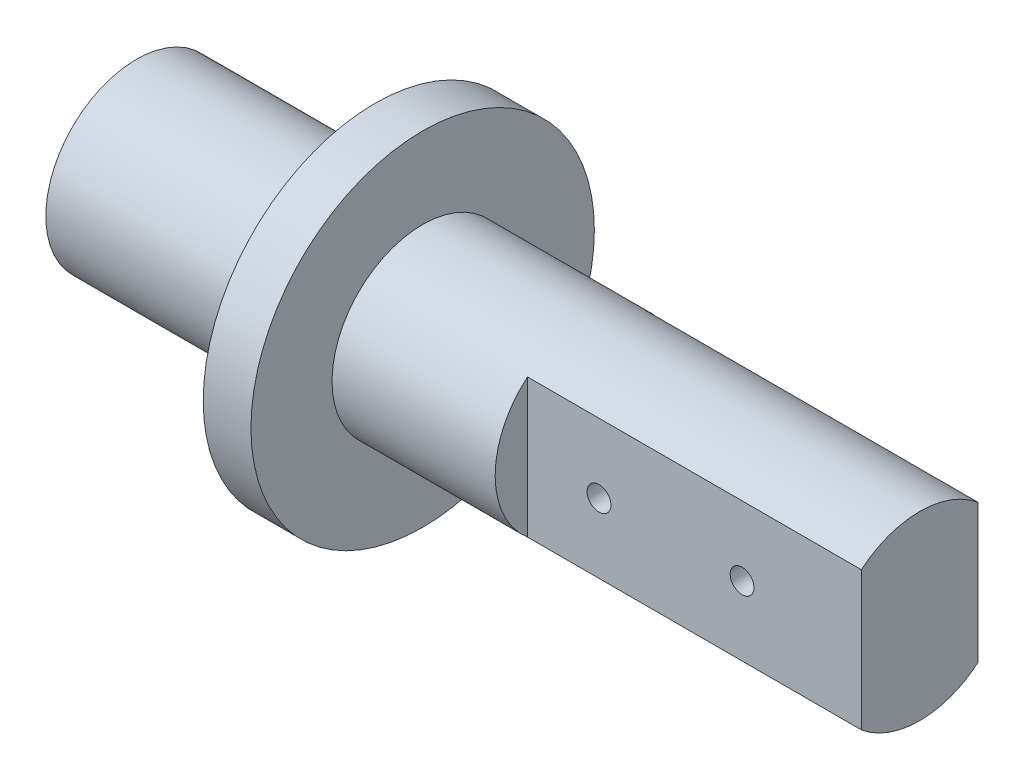
ISO-10303-21;
HEADER;
FILE_DESCRIPTION(('STEP AP214'),'2;1');
FILE_NAME('part.step','',(''),(''),'','','');
FILE_SCHEMA(('AUTOMOTIVE_DESIGN { 1 0 10303 214 1 1 1 1 }'));
ENDSEC;
DATA;
#1=APPLICATION_CONTEXT('core data for automotive mechanical design processes');
#2=APPLICATION_PROTOCOL_DEFINITION('international standard','automotive_design',2000,#1);
#3=PRODUCT_CONTEXT('',#1,'mechanical');
#4=PRODUCT('Part','Part','',(#3));
#5=PRODUCT_RELATED_PRODUCT_CATEGORY('part','',(#4));
#6=PRODUCT_DEFINITION_FORMATION('','',#4);
#7=PRODUCT_DEFINITION_CONTEXT('part definition',#1,'design');
#8=PRODUCT_DEFINITION('design','',#6,#7);
#9=PRODUCT_DEFINITION_SHAPE('','',#8);
#10=(LENGTH_UNIT() NAMED_UNIT(*) SI_UNIT(.MILLI.,.METRE.));
#11=(NAMED_UNIT(*) PLANE_ANGLE_UNIT() SI_UNIT($,.RADIAN.));
#12=(NAMED_UNIT(*) SI_UNIT($,.STERADIAN.) SOLID_ANGLE_UNIT());
#13=UNCERTAINTY_MEASURE_WITH_UNIT(LENGTH_MEASURE(1.E-05),#10,'distance_accuracy_value','');
#14=(GEOMETRIC_REPRESENTATION_CONTEXT(3) GLOBAL_UNCERTAINTY_ASSIGNED_CONTEXT((#13)) GLOBAL_UNIT_ASSIGNED_CONTEXT((#10,
#11,#12)) REPRESENTATION_CONTEXT('',''));
#15=CARTESIAN_POINT('',(0.,0.,0.));
#16=DIRECTION('',(0.,0.,1.));
#17=DIRECTION('',(1.,0.,0.));
#18=AXIS2_PLACEMENT_3D('',#15,#16,#17);
#19=CARTESIAN_POINT('',(0.,0.,0.));
#20=DIRECTION('',(-1.,0.,0.));
#21=DIRECTION('',(0.,0.,1.));
#22=AXIS2_PLACEMENT_3D('',#19,#20,#21);
#23=CYLINDRICAL_SURFACE('',#22,9.5);
#24=CARTESIAN_POINT('',(18.7571862711397,-0.133843323913922,9.49905710924214));
#25=CARTESIAN_POINT('',(18.7497191225898,-0.0644792715354372,9.50003343309708));
#26=CARTESIAN_POINT('',(18.7480669160832,0.00556405323647919,9.50025344602568));
#27=CARTESIAN_POINT('',(18.7564698736311,0.144979561522329,9.4991501404317));
#28=CARTESIAN_POINT('',(18.766536582819,0.214351015191011,9.49782529996253));
#29=CARTESIAN_POINT('',(18.7980796029942,0.350366331225342,9.49378059106666));
#30=CARTESIAN_POINT('',(18.8195490331772,0.417011812445685,9.49106156397555));
#31=CARTESIAN_POINT('',(18.8732622691699,0.545734422655254,9.48453117210074));
#32=CARTESIAN_POINT('',(18.9055043688729,0.607812273138289,9.48071998030071));
#33=CARTESIAN_POINT('',(18.980012367083,0.725964552348348,9.47240745265404));
#34=CARTESIAN_POINT('',(19.0223221240447,0.782011109915849,9.46790312848224));
#35=CARTESIAN_POINT('',(19.1157064001351,0.886240137139336,9.45871669072787));
#36=CARTESIAN_POINT('',(19.1667815153281,0.934422071547889,9.45403456507126));
#37=CARTESIAN_POINT('',(19.276627488953,1.02185619495898,9.44498592507392));
#38=CARTESIAN_POINT('',(19.3354441844691,1.06105105031087,9.44062155209812));
#39=CARTESIAN_POINT('',(19.4588782560648,1.12900411397511,9.43273687670716));
#40=CARTESIAN_POINT('',(19.5234955036514,1.15776255340239,9.42921655560101));
#41=CARTESIAN_POINT('',(19.6564987756165,1.20392977740594,9.42343337261771));
#42=CARTESIAN_POINT('',(19.7248727157887,1.22137287959152,9.4211667117012));
#43=CARTESIAN_POINT('',(19.8636103529643,1.24452529660299,9.41813651838227));
#44=CARTESIAN_POINT('',(19.9339739399041,1.25023525920218,9.41737290299852));
#45=CARTESIAN_POINT('',(20.0741180473625,1.2497517017472,9.41743702976489));
#46=CARTESIAN_POINT('',(20.1438989048636,1.24364904358161,9.41825262474987));
#47=CARTESIAN_POINT('',(20.2814336529233,1.21990371925658,9.42135745067241));
#48=CARTESIAN_POINT('',(20.3491875416964,1.20226104293217,9.42364668290801));
#49=CARTESIAN_POINT('',(20.480743116948,1.15596182651778,9.42943754488172));
#50=CARTESIAN_POINT('',(20.5445458358198,1.12730817768202,9.43293885632892));
#51=CARTESIAN_POINT('',(20.6664552359945,1.05980782384128,9.44076039951871));
#52=CARTESIAN_POINT('',(20.7245616357526,1.02096061536062,9.4450806717081));
#53=CARTESIAN_POINT('',(20.8338984806609,0.933828974038488,9.45409385220929));
#54=CARTESIAN_POINT('',(20.885073778255,0.885475593717308,9.45878932455992));
#55=CARTESIAN_POINT('',(20.9786065215152,0.780866430075416,9.4679986824394));
#56=CARTESIAN_POINT('',(21.0209637465793,0.724610449113877,9.47251256342309));
#57=CARTESIAN_POINT('',(21.0958030235709,0.605539355360445,9.48086976017443));
#58=CARTESIAN_POINT('',(21.1282487731954,0.542701236249752,9.48471058940574));
#59=CARTESIAN_POINT('',(21.1821115457805,0.412408807957424,9.49126803634612));
#60=CARTESIAN_POINT('',(21.203529026196,0.344954690379857,9.49398470068487));
#61=CARTESIAN_POINT('',(21.2346061809182,0.207763032854201,9.49797421108078));
#62=CARTESIAN_POINT('',(21.2443337745644,0.138041124441231,9.4992553944454));
#63=CARTESIAN_POINT('',(21.2519651241998,-0.00205653685352284,9.50025797279816));
#64=CARTESIAN_POINT('',(21.249869366228,-0.0724322627391881,9.49997943190406));
#65=CARTESIAN_POINT('',(21.2339681065827,-0.211383856020531,9.49790067530691));
#66=CARTESIAN_POINT('',(21.2202346292857,-0.279968125199801,9.49610981936629));
#67=CARTESIAN_POINT('',(21.1815597652179,-0.413850068958151,9.49121796297753));
#68=CARTESIAN_POINT('',(21.1566181539444,-0.479147677675186,9.48811693628631));
#69=CARTESIAN_POINT('',(21.096156312494,-0.604829835387539,9.48093661981255));
#70=CARTESIAN_POINT('',(21.0606043437987,-0.665198941952211,9.47685440224967));
#71=CARTESIAN_POINT('',(20.9799543620407,-0.779141796266092,9.46816815868444));
#72=CARTESIAN_POINT('',(20.9348558578671,-0.832715194190853,9.46356410584252));
#73=CARTESIAN_POINT('',(20.8359870238673,-0.931970546159648,9.45430798542196));
#74=CARTESIAN_POINT('',(20.7821536989094,-0.9775897640859,9.44965581802707));
#75=CARTESIAN_POINT('',(20.6675606826757,-1.05915474905901,9.44086222125012));
#76=CARTESIAN_POINT('',(20.6068009758146,-1.09510049433848,9.43672079301734));
#77=CARTESIAN_POINT('',(20.4800260933277,-1.15630060773529,9.42941800330284));
#78=CARTESIAN_POINT('',(20.4140086301521,-1.18155029167616,9.42625707137639));
#79=CARTESIAN_POINT('',(20.2786196091799,-1.22058753162685,9.42128212839032));
#80=CARTESIAN_POINT('',(20.2092482258022,-1.23437568301045,9.41946804736853));
#81=CARTESIAN_POINT('',(20.0696770146042,-1.25001578901799,9.41740533972257));
#82=CARTESIAN_POINT('',(19.9994872830052,-1.25195636866387,9.41714509008395));
#83=CARTESIAN_POINT('',(19.8597839001592,-1.24407956860155,9.4181888493365));
#84=CARTESIAN_POINT('',(19.7902702339264,-1.23426245012179,9.41949282347429));
#85=CARTESIAN_POINT('',(19.6541538459982,-1.20322302888803,9.42350758955671));
#86=CARTESIAN_POINT('',(19.587541324056,-1.1820429706235,9.42621316941837));
#87=CARTESIAN_POINT('',(19.4588147107473,-1.12892288538793,9.43272202907677));
#88=CARTESIAN_POINT('',(19.3967006531188,-1.09698277772767,9.43652531710514));
#89=CARTESIAN_POINT('',(19.2783359388641,-1.02303423463727,9.4448286559659));
#90=CARTESIAN_POINT('',(19.2221213242369,-0.980968558751438,9.4493326146031));
#91=CARTESIAN_POINT('',(19.1175063990004,-0.888032217775664,9.45851856141931));
#92=CARTESIAN_POINT('',(19.0691080485902,-0.837159350584597,9.46320059389391));
#93=CARTESIAN_POINT('',(18.9811880300445,-0.72765848566234,9.47225147965771));
#94=CARTESIAN_POINT('',(18.9417281493417,-0.668980707507695,9.47661801890231));
#95=CARTESIAN_POINT('',(18.8732619564631,-0.545816303637497,9.48450716558606));
#96=CARTESIAN_POINT('',(18.8442446968534,-0.481335850307806,9.48803065552202));
#97=CARTESIAN_POINT('',(18.804886095254,-0.369491516358376,9.49292106017614));
#98=CARTESIAN_POINT('',(18.7915404773749,-0.323175076086507,9.49461755714822));
#99=CARTESIAN_POINT('',(18.7702681725671,-0.229294778749665,9.49734856170854));
#100=CARTESIAN_POINT('',(18.762341446779,-0.181730930632482,9.49838307404391));
#101=CARTESIAN_POINT('',(18.7571862711397,-0.133843323913922,9.49905710924214));
#102=B_SPLINE_CURVE_WITH_KNOTS('',3,(#24,#25,#26,#27,#28,#29,#30,#31,#32,#33,#34,#35,#36,#37,
#38,#39,#40,#41,#42,#43,#44,#45,#46,#47,#48,#49,#50,#51,#52,#53,#54,#55,#56,#57,#58,#59,#60,#61,
#62,#63,#64,#65,#66,#67,#68,#69,#70,#71,#72,#73,#74,#75,#76,#77,#78,#79,#80,#81,#82,#83,#84,#85,
#86,#87,#88,#89,#90,#91,#92,#93,#94,#95,#96,#97,#98,#99,#100,#101),.UNSPECIFIED.,.T.,.F.,(4,2,2,
2,2,2,2,2,2,2,2,2,2,2,2,2,2,2,2,2,2,2,2,2,2,2,2,2,2,2,2,2,2,2,2,2,2,2,4),(0.,0.209139655009107,
0.418485522785862,0.627705207165943,0.836891772359222,1.04700687661839,1.25713627485178,
1.4685710582632,1.68000115915521,1.8907869907077,2.10156118470126,2.31072055855557,
2.51988011664733,2.72898479124065,2.93809979578234,3.14879151172392,3.35948849791804,
3.57094818879147,3.78239910756716,3.9926154431566,4.20282313715398,4.41173930435003,
4.62065965639331,4.83021131987617,5.03977376613028,5.25092086306614,5.46206843512397,
5.67330838067465,5.88453735259802,6.09418428390281,6.30382655743177,6.51269478176198,
6.721564572422,6.93164405516653,7.14177614108067,7.35331922359407,7.56463988619237,
7.70902691413943,7.85341290666598),.UNSPECIFIED.);
#103=CARTESIAN_POINT('',(18.7571862711397,-0.133843323913922,9.49905710924214));
#104=VERTEX_POINT('',#103);
#105=EDGE_CURVE('E12',#104,#104,#102,.T.);
#106=ORIENTED_EDGE('',*,*,#105,.T.);
#107=EDGE_LOOP('',(#106));
#108=FACE_BOUND('',#107,.T.);
#109=CARTESIAN_POINT('',(0.,0.,0.));
#110=DIRECTION('',(1.,0.,0.));
#111=DIRECTION('',(0.,0.,-1.));
#112=AXIS2_PLACEMENT_3D('',#109,#110,#111);
#113=CIRCLE('',#112,9.5);
#114=CARTESIAN_POINT('',(0.,0.,-9.5));
#115=VERTEX_POINT('',#114);
#116=EDGE_CURVE('E173',#115,#115,#113,.F.);
#117=ORIENTED_EDGE('',*,*,#116,.F.);
#118=EDGE_LOOP('',(#117));
#119=FACE_BOUND('',#118,.T.);
#120=CARTESIAN_POINT('',(25.,0.,0.));
#121=DIRECTION('',(1.,0.,0.));
#122=DIRECTION('',(0.,0.,-1.));
#123=AXIS2_PLACEMENT_3D('',#120,#121,#122);
#124=CIRCLE('',#123,9.5);
#125=CARTESIAN_POINT('',(25.,0.,-9.5));
#126=VERTEX_POINT('',#125);
#127=EDGE_CURVE('E50',#126,#126,#124,.T.);
#128=ORIENTED_EDGE('',*,*,#127,.F.);
#129=EDGE_LOOP('',(#128));
#130=FACE_BOUND('',#129,.T.);
#131=ADVANCED_FACE('F46',(#108,#119,#130),#23,.T.);
#132=CARTESIAN_POINT('',(0.,0.,0.));
#133=DIRECTION('',(1.,0.,0.));
#134=DIRECTION('',(0.,0.,-1.));
#135=AXIS2_PLACEMENT_3D('',#132,#133,#134);
#136=PLANE('',#135);
#137=ORIENTED_EDGE('',*,*,#116,.T.);
#138=EDGE_LOOP('',(#137));
#139=FACE_BOUND('',#138,.T.);
#140=ADVANCED_FACE('F209',(#139),#136,.F.);
#141=CARTESIAN_POINT('',(25.,0.,0.));
#142=DIRECTION('',(1.,0.,0.));
#143=DIRECTION('',(0.,0.,-1.));
#144=AXIS2_PLACEMENT_3D('',#141,#142,#143);
#145=CYLINDRICAL_SURFACE('',#144,18.);
#146=CARTESIAN_POINT('',(25.,0.,0.));
#147=DIRECTION('',(1.,0.,0.));
#148=DIRECTION('',(0.,0.,-1.));
#149=AXIS2_PLACEMENT_3D('',#146,#147,#148);
#150=CIRCLE('',#149,18.);
#151=CARTESIAN_POINT('',(25.,0.,-18.));
#152=VERTEX_POINT('',#151);
#153=EDGE_CURVE('E137',#152,#152,#150,.T.);
#154=ORIENTED_EDGE('',*,*,#153,.T.);
#155=EDGE_LOOP('',(#154));
#156=FACE_BOUND('',#155,.T.);
#157=CARTESIAN_POINT('',(30.,0.,0.));
#158=DIRECTION('',(1.,0.,0.));
#159=DIRECTION('',(0.,0.,-1.));
#160=AXIS2_PLACEMENT_3D('',#157,#158,#159);
#161=CIRCLE('',#160,18.);
#162=CARTESIAN_POINT('',(30.,0.,-18.));
#163=VERTEX_POINT('',#162);
#164=EDGE_CURVE('E136',#163,#163,#161,.T.);
#165=ORIENTED_EDGE('',*,*,#164,.F.);
#166=EDGE_LOOP('',(#165));
#167=FACE_BOUND('',#166,.T.);
#168=ADVANCED_FACE('F201',(#156,#167),#145,.T.);
#169=CARTESIAN_POINT('',(25.,0.,0.));
#170=DIRECTION('',(1.,0.,0.));
#171=DIRECTION('',(0.,0.,-1.));
#172=AXIS2_PLACEMENT_3D('',#169,#170,#171);
#173=PLANE('',#172);
#174=ORIENTED_EDGE('',*,*,#127,.T.);
#175=EDGE_LOOP('',(#174));
#176=FACE_BOUND('',#175,.T.);
#177=ORIENTED_EDGE('',*,*,#153,.F.);
#178=EDGE_LOOP('',(#177));
#179=FACE_BOUND('',#178,.T.);
#180=ADVANCED_FACE('F197',(#176,#179),#173,.F.);
#181=CARTESIAN_POINT('',(30.,0.,0.));
#182=DIRECTION('',(1.,0.,0.));
#183=DIRECTION('',(0.,0.,-1.));
#184=AXIS2_PLACEMENT_3D('',#181,#182,#183);
#185=PLANE('',#184);
#186=CARTESIAN_POINT('',(30.,0.,0.));
#187=DIRECTION('',(1.,0.,0.));
#188=DIRECTION('',(0.,0.,-1.));
#189=AXIS2_PLACEMENT_3D('',#186,#187,#188);
#190=CIRCLE('',#189,9.5);
#191=CARTESIAN_POINT('',(30.,0.,-9.5));
#192=VERTEX_POINT('',#191);
#193=EDGE_CURVE('E140',#192,#192,#190,.T.);
#194=ORIENTED_EDGE('',*,*,#193,.F.);
#195=EDGE_LOOP('',(#194));
#196=FACE_BOUND('',#195,.T.);
#197=ORIENTED_EDGE('',*,*,#164,.T.);
#198=EDGE_LOOP('',(#197));
#199=FACE_BOUND('',#198,.T.);
#200=ADVANCED_FACE('F200',(#196,#199),#185,.T.);
#201=CARTESIAN_POINT('',(47.1,10.,0.));
#202=DIRECTION('',(-1.,0.,0.));
#203=DIRECTION('',(0.,0.,1.));
#204=AXIS2_PLACEMENT_3D('',#201,#202,#203);
#205=PLANE('',#204);
#206=DIRECTION('',(0.,1.,0.));
#207=VECTOR('',#206,1.);
#208=CARTESIAN_POINT('',(47.1,10.,-6.11437827766147));
#209=LINE('',#208,#207);
#210=CARTESIAN_POINT('',(47.1,-7.27078938476845,-6.11437827766147));
#211=VERTEX_POINT('',#210);
#212=CARTESIAN_POINT('',(47.1,7.27078938476845,-6.11437827766147));
#213=VERTEX_POINT('',#212);
#214=EDGE_CURVE('E158',#211,#213,#209,.T.);
#215=ORIENTED_EDGE('',*,*,#214,.F.);
#216=CARTESIAN_POINT('',(47.1,0.,0.));
#217=DIRECTION('',(-1.,0.,0.));
#218=DIRECTION('',(0.,0.,1.));
#219=AXIS2_PLACEMENT_3D('',#216,#217,#218);
#220=CIRCLE('',#219,9.5);
#221=EDGE_CURVE('E87',#213,#211,#220,.T.);
#222=ORIENTED_EDGE('',*,*,#221,.F.);
#223=EDGE_LOOP('',(#215,#222));
#224=FACE_BOUND('',#223,.T.);
#225=ADVANCED_FACE('F205',(#224),#205,.F.);
#226=CARTESIAN_POINT('',(77.1,-7.5,-6.11437827766147));
#227=DIRECTION('',(0.,0.,1.));
#228=DIRECTION('',(1.,0.,0.));
#229=AXIS2_PLACEMENT_3D('',#226,#227,#228);
#230=PLANE('',#229);
#231=CARTESIAN_POINT('',(69.6,0.,-6.11437827766147));
#232=DIRECTION('',(0.,0.,1.));
#233=DIRECTION('',(1.,0.,0.));
#234=AXIS2_PLACEMENT_3D('',#231,#232,#233);
#235=CIRCLE('',#234,1.24999999999999);
#236=CARTESIAN_POINT('',(70.85,0.,-6.11437827766147));
#237=VERTEX_POINT('',#236);
#238=EDGE_CURVE('E125',#237,#237,#235,.F.);
#239=ORIENTED_EDGE('',*,*,#238,.F.);
#240=EDGE_LOOP('',(#239));
#241=FACE_BOUND('',#240,.T.);
#242=CARTESIAN_POINT('',(54.6,0.,-6.11437827766147));
#243=DIRECTION('',(0.,0.,1.));
#244=DIRECTION('',(1.,0.,0.));
#245=AXIS2_PLACEMENT_3D('',#242,#243,#244);
#246=CIRCLE('',#245,1.24999999999999);
#247=CARTESIAN_POINT('',(55.85,0.,-6.11437827766147));
#248=VERTEX_POINT('',#247);
#249=EDGE_CURVE('E129',#248,#248,#246,.F.);
#250=ORIENTED_EDGE('',*,*,#249,.F.);
#251=EDGE_LOOP('',(#250));
#252=FACE_BOUND('',#251,.T.);
#253=ORIENTED_EDGE('',*,*,#214,.T.);
#254=DIRECTION('',(-1.,0.,0.));
#255=VECTOR('',#254,1.);
#256=CARTESIAN_POINT('',(82.1,7.27078938476845,-6.11437827766147));
#257=LINE('',#256,#255);
#258=CARTESIAN_POINT('',(82.1,7.27078938476845,-6.11437827766147));
#259=VERTEX_POINT('',#258);
#260=EDGE_CURVE('E146',#259,#213,#257,.T.);
#261=ORIENTED_EDGE('',*,*,#260,.F.);
#262=DIRECTION('',(0.,1.,0.));
#263=VECTOR('',#262,1.);
#264=CARTESIAN_POINT('',(82.1,-7.5,-6.11437827766147));
#265=LINE('',#264,#263);
#266=CARTESIAN_POINT('',(82.1,-7.27078938476845,-6.11437827766147));
#267=VERTEX_POINT('',#266);
#268=EDGE_CURVE('E164',#267,#259,#265,.T.);
#269=ORIENTED_EDGE('',*,*,#268,.F.);
#270=DIRECTION('',(-1.,0.,0.));
#271=VECTOR('',#270,1.);
#272=CARTESIAN_POINT('',(82.1,-7.27078938476845,-6.11437827766147));
#273=LINE('',#272,#271);
#274=EDGE_CURVE('E150',#267,#211,#273,.T.);
#275=ORIENTED_EDGE('',*,*,#274,.T.);
#276=EDGE_LOOP('',(#253,#261,#269,#275));
#277=FACE_BOUND('',#276,.T.);
#278=ADVANCED_FACE('F246',(#241,#252,#277),#230,.F.);
#279=CARTESIAN_POINT('',(77.1,-7.5,6.11437827766147));
#280=DIRECTION('',(0.,0.,-1.));
#281=DIRECTION('',(-1.,0.,0.));
#282=AXIS2_PLACEMENT_3D('',#279,#280,#281);
#283=PLANE('',#282);
#284=CARTESIAN_POINT('',(54.6,0.,6.11437827766147));
#285=DIRECTION('',(0.,0.,-1.));
#286=DIRECTION('',(-1.,0.,0.));
#287=AXIS2_PLACEMENT_3D('',#284,#285,#286);
#288=CIRCLE('',#287,1.24999999999999);
#289=CARTESIAN_POINT('',(53.35,0.,6.11437827766147));
#290=VERTEX_POINT('',#289);
#291=EDGE_CURVE('E114',#290,#290,#288,.F.);
#292=ORIENTED_EDGE('',*,*,#291,.F.);
#293=EDGE_LOOP('',(#292));
#294=FACE_BOUND('',#293,.T.);
#295=CARTESIAN_POINT('',(69.6,0.,6.11437827766147));
#296=DIRECTION('',(0.,0.,-1.));
#297=DIRECTION('',(-1.,0.,0.));
#298=AXIS2_PLACEMENT_3D('',#295,#296,#297);
#299=CIRCLE('',#298,1.24999999999999);
#300=CARTESIAN_POINT('',(68.35,0.,6.11437827766147));
#301=VERTEX_POINT('',#300);
#302=EDGE_CURVE('E113',#301,#301,#299,.F.);
#303=ORIENTED_EDGE('',*,*,#302,.F.);
#304=EDGE_LOOP('',(#303));
#305=FACE_BOUND('',#304,.T.);
#306=DIRECTION('',(0.,-1.,0.));
#307=VECTOR('',#306,1.);
#308=CARTESIAN_POINT('',(47.1,10.,6.11437827766147));
#309=LINE('',#308,#307);
#310=CARTESIAN_POINT('',(47.1,7.27078938476845,6.11437827766147));
#311=VERTEX_POINT('',#310);
#312=CARTESIAN_POINT('',(47.1,-7.27078938476845,6.11437827766147));
#313=VERTEX_POINT('',#312);
#314=EDGE_CURVE('E155',#311,#313,#309,.T.);
#315=ORIENTED_EDGE('',*,*,#314,.T.);
#316=DIRECTION('',(-1.,0.,0.));
#317=VECTOR('',#316,1.);
#318=CARTESIAN_POINT('',(82.1,-7.27078938476845,6.11437827766147));
#319=LINE('',#318,#317);
#320=CARTESIAN_POINT('',(82.1,-7.27078938476845,6.11437827766147));
#321=VERTEX_POINT('',#320);
#322=EDGE_CURVE('E147',#321,#313,#319,.T.);
#323=ORIENTED_EDGE('',*,*,#322,.F.);
#324=DIRECTION('',(0.,-1.,0.));
#325=VECTOR('',#324,1.);
#326=CARTESIAN_POINT('',(82.1,-7.5,6.11437827766147));
#327=LINE('',#326,#325);
#328=CARTESIAN_POINT('',(82.1,7.27078938476845,6.11437827766147));
#329=VERTEX_POINT('',#328);
#330=EDGE_CURVE('E120',#329,#321,#327,.T.);
#331=ORIENTED_EDGE('',*,*,#330,.F.);
#332=DIRECTION('',(-1.,0.,0.));
#333=VECTOR('',#332,1.);
#334=CARTESIAN_POINT('',(82.1,7.27078938476845,6.11437827766147));
#335=LINE('',#334,#333);
#336=EDGE_CURVE('E143',#329,#311,#335,.T.);
#337=ORIENTED_EDGE('',*,*,#336,.T.);
#338=EDGE_LOOP('',(#315,#323,#331,#337));
#339=FACE_BOUND('',#338,.T.);
#340=ADVANCED_FACE('F48',(#294,#305,#339),#283,.F.);
#341=ORIENTED_EDGE('',*,*,#314,.F.);
#342=CARTESIAN_POINT('',(47.1,0.,0.));
#343=DIRECTION('',(-1.,0.,0.));
#344=DIRECTION('',(0.,0.,1.));
#345=AXIS2_PLACEMENT_3D('',#342,#343,#344);
#346=CIRCLE('',#345,9.5);
#347=EDGE_CURVE('E62',#313,#311,#346,.T.);
#348=ORIENTED_EDGE('',*,*,#347,.F.);
#349=EDGE_LOOP('',(#341,#348));
#350=FACE_BOUND('',#349,.T.);
#351=ADVANCED_FACE('F211',(#350),#205,.F.);
#352=ORIENTED_EDGE('',*,*,#193,.T.);
#353=EDGE_LOOP('',(#352));
#354=FACE_BOUND('',#353,.T.);
#355=ORIENTED_EDGE('',*,*,#347,.T.);
#356=ORIENTED_EDGE('',*,*,#336,.F.);
#357=CARTESIAN_POINT('',(82.1,0.,0.));
#358=DIRECTION('',(1.,0.,0.));
#359=DIRECTION('',(0.,0.,-1.));
#360=AXIS2_PLACEMENT_3D('',#357,#358,#359);
#361=CIRCLE('',#360,9.5);
#362=EDGE_CURVE('E161',#259,#329,#361,.T.);
#363=ORIENTED_EDGE('',*,*,#362,.F.);
#364=ORIENTED_EDGE('',*,*,#260,.T.);
#365=ORIENTED_EDGE('',*,*,#221,.T.);
#366=ORIENTED_EDGE('',*,*,#274,.F.);
#367=CARTESIAN_POINT('',(82.1,0.,0.));
#368=DIRECTION('',(1.,0.,0.));
#369=DIRECTION('',(0.,0.,-1.));
#370=AXIS2_PLACEMENT_3D('',#367,#368,#369);
#371=CIRCLE('',#370,9.5);
#372=EDGE_CURVE('E167',#321,#267,#371,.T.);
#373=ORIENTED_EDGE('',*,*,#372,.F.);
#374=ORIENTED_EDGE('',*,*,#322,.T.);
#375=EDGE_LOOP('',(#355,#356,#363,#364,#365,#366,#373,#374));
#376=FACE_BOUND('',#375,.T.);
#377=ADVANCED_FACE('F183',(#354,#376),#23,.T.);
#378=CARTESIAN_POINT('',(20.,0.,10.));
#379=DIRECTION('',(0.,0.,1.));
#380=DIRECTION('',(1.,0.,0.));
#381=AXIS2_PLACEMENT_3D('',#378,#379,#380);
#382=CYLINDRICAL_SURFACE('',#381,1.24999999999999);
#383=CARTESIAN_POINT('',(20.,0.,0.));
#384=DIRECTION('',(0.,0.,1.));
#385=DIRECTION('',(1.,0.,0.));
#386=AXIS2_PLACEMENT_3D('',#383,#384,#385);
#387=CIRCLE('',#386,1.25);
#388=CARTESIAN_POINT('',(21.25,0.,0.));
#389=VERTEX_POINT('',#388);
#390=EDGE_CURVE('E133',#389,#389,#387,.T.);
#391=ORIENTED_EDGE('',*,*,#390,.F.);
#392=EDGE_LOOP('',(#391));
#393=FACE_BOUND('',#392,.T.);
#394=ORIENTED_EDGE('',*,*,#105,.F.);
#395=EDGE_LOOP('',(#394));
#396=FACE_BOUND('',#395,.T.);
#397=ADVANCED_FACE('F186',(#393,#396),#382,.F.);
#398=CARTESIAN_POINT('',(20.,0.,0.));
#399=DIRECTION('',(0.,0.,1.));
#400=DIRECTION('',(1.,0.,0.));
#401=AXIS2_PLACEMENT_3D('',#398,#399,#400);
#402=CONICAL_SURFACE('',#401,1.25,1.02974425867665);
#403=CARTESIAN_POINT('',(20.,0.,-0.751075773784452));
#404=VERTEX_POINT('',#403);
#405=VERTEX_LOOP('',#404);
#406=FACE_BOUND('',#405,.T.);
#407=ORIENTED_EDGE('',*,*,#390,.T.);
#408=EDGE_LOOP('',(#407));
#409=FACE_BOUND('',#408,.T.);
#410=ADVANCED_FACE('F191',(#406,#409),#402,.F.);
#411=CARTESIAN_POINT('',(54.6,0.,-1.61437827766148));
#412=DIRECTION('',(0.,0.,-1.));
#413=DIRECTION('',(-1.,0.,0.));
#414=AXIS2_PLACEMENT_3D('',#411,#412,#413);
#415=CONICAL_SURFACE('',#414,1.25,1.02974425867665);
#416=CARTESIAN_POINT('',(54.6,0.,-0.863302503877024));
#417=VERTEX_POINT('',#416);
#418=VERTEX_LOOP('',#417);
#419=FACE_BOUND('',#418,.T.);
#420=CARTESIAN_POINT('',(54.6,0.,-1.61437827766148));
#421=DIRECTION('',(0.,0.,-1.));
#422=DIRECTION('',(-1.,0.,0.));
#423=AXIS2_PLACEMENT_3D('',#420,#421,#422);
#424=CIRCLE('',#423,1.25);
#425=CARTESIAN_POINT('',(53.35,0.,-1.61437827766148));
#426=VERTEX_POINT('',#425);
#427=EDGE_CURVE('E130',#426,#426,#424,.T.);
#428=ORIENTED_EDGE('',*,*,#427,.T.);
#429=EDGE_LOOP('',(#428));
#430=FACE_BOUND('',#429,.T.);
#431=ADVANCED_FACE('F193',(#419,#430),#415,.F.);
#432=CARTESIAN_POINT('',(54.6,0.,-6.61437827766147));
#433=DIRECTION('',(0.,0.,-1.));
#434=DIRECTION('',(-1.,0.,0.));
#435=AXIS2_PLACEMENT_3D('',#432,#433,#434);
#436=CYLINDRICAL_SURFACE('',#435,1.24999999999999);
#437=ORIENTED_EDGE('',*,*,#427,.F.);
#438=EDGE_LOOP('',(#437));
#439=FACE_BOUND('',#438,.T.);
#440=ORIENTED_EDGE('',*,*,#249,.T.);
#441=EDGE_LOOP('',(#440));
#442=FACE_BOUND('',#441,.T.);
#443=ADVANCED_FACE('F260',(#439,#442),#436,.F.);
#444=CARTESIAN_POINT('',(69.6,0.,-1.61437827766148));
#445=DIRECTION('',(0.,0.,-1.));
#446=DIRECTION('',(-1.,0.,0.));
#447=AXIS2_PLACEMENT_3D('',#444,#445,#446);
#448=CONICAL_SURFACE('',#447,1.25,1.02974425867665);
#449=CARTESIAN_POINT('',(69.6,0.,-0.863302503877024));
#450=VERTEX_POINT('',#449);
#451=VERTEX_LOOP('',#450);
#452=FACE_BOUND('',#451,.T.);
#453=CARTESIAN_POINT('',(69.6,0.,-1.61437827766148));
#454=DIRECTION('',(0.,0.,-1.));
#455=DIRECTION('',(-1.,0.,0.));
#456=AXIS2_PLACEMENT_3D('',#453,#454,#455);
#457=CIRCLE('',#456,1.25);
#458=CARTESIAN_POINT('',(68.35,0.,-1.61437827766148));
#459=VERTEX_POINT('',#458);
#460=EDGE_CURVE('E126',#459,#459,#457,.T.);
#461=ORIENTED_EDGE('',*,*,#460,.T.);
#462=EDGE_LOOP('',(#461));
#463=FACE_BOUND('',#462,.T.);
#464=ADVANCED_FACE('F262',(#452,#463),#448,.F.);
#465=CARTESIAN_POINT('',(69.6,0.,-6.61437827766147));
#466=DIRECTION('',(0.,0.,-1.));
#467=DIRECTION('',(-1.,0.,0.));
#468=AXIS2_PLACEMENT_3D('',#465,#466,#467);
#469=CYLINDRICAL_SURFACE('',#468,1.24999999999999);
#470=ORIENTED_EDGE('',*,*,#460,.F.);
#471=EDGE_LOOP('',(#470));
#472=FACE_BOUND('',#471,.T.);
#473=ORIENTED_EDGE('',*,*,#238,.T.);
#474=EDGE_LOOP('',(#473));
#475=FACE_BOUND('',#474,.T.);
#476=ADVANCED_FACE('F268',(#472,#475),#469,.F.);
#477=CARTESIAN_POINT('',(69.6,0.,1.61437827766148));
#478=DIRECTION('',(0.,0.,1.));
#479=DIRECTION('',(1.,0.,0.));
#480=AXIS2_PLACEMENT_3D('',#477,#478,#479);
#481=CONICAL_SURFACE('',#480,1.25,1.02974425867665);
#482=CARTESIAN_POINT('',(69.6,0.,0.863302503877024));
#483=VERTEX_POINT('',#482);
#484=VERTEX_LOOP('',#483);
#485=FACE_BOUND('',#484,.T.);
#486=CARTESIAN_POINT('',(69.6,0.,1.61437827766148));
#487=DIRECTION('',(0.,0.,1.));
#488=DIRECTION('',(1.,0.,0.));
#489=AXIS2_PLACEMENT_3D('',#486,#487,#488);
#490=CIRCLE('',#489,1.25);
#491=CARTESIAN_POINT('',(70.85,0.,1.61437827766148));
#492=VERTEX_POINT('',#491);
#493=EDGE_CURVE('E117',#492,#492,#490,.T.);
#494=ORIENTED_EDGE('',*,*,#493,.T.);
#495=EDGE_LOOP('',(#494));
#496=FACE_BOUND('',#495,.T.);
#497=ADVANCED_FACE('F275',(#485,#496),#481,.F.);
#498=CARTESIAN_POINT('',(69.6,0.,6.61437827766147));
#499=DIRECTION('',(0.,0.,1.));
#500=DIRECTION('',(1.,0.,0.));
#501=AXIS2_PLACEMENT_3D('',#498,#499,#500);
#502=CYLINDRICAL_SURFACE('',#501,1.24999999999999);
#503=ORIENTED_EDGE('',*,*,#493,.F.);
#504=EDGE_LOOP('',(#503));
#505=FACE_BOUND('',#504,.T.);
#506=ORIENTED_EDGE('',*,*,#302,.T.);
#507=EDGE_LOOP('',(#506));
#508=FACE_BOUND('',#507,.T.);
#509=ADVANCED_FACE('F107',(#505,#508),#502,.F.);
#510=CARTESIAN_POINT('',(54.6,0.,1.61437827766148));
#511=DIRECTION('',(0.,0.,1.));
#512=DIRECTION('',(1.,0.,0.));
#513=AXIS2_PLACEMENT_3D('',#510,#511,#512);
#514=CONICAL_SURFACE('',#513,1.25,1.02974425867665);
#515=CARTESIAN_POINT('',(54.6,0.,0.863302503877024));
#516=VERTEX_POINT('',#515);
#517=VERTEX_LOOP('',#516);
#518=FACE_BOUND('',#517,.T.);
#519=CARTESIAN_POINT('',(54.6,0.,1.61437827766148));
#520=DIRECTION('',(0.,0.,1.));
#521=DIRECTION('',(1.,0.,0.));
#522=AXIS2_PLACEMENT_3D('',#519,#520,#521);
#523=CIRCLE('',#522,1.25);
#524=CARTESIAN_POINT('',(55.85,0.,1.61437827766148));
#525=VERTEX_POINT('',#524);
#526=EDGE_CURVE('E111',#525,#525,#523,.T.);
#527=ORIENTED_EDGE('',*,*,#526,.T.);
#528=EDGE_LOOP('',(#527));
#529=FACE_BOUND('',#528,.T.);
#530=ADVANCED_FACE('F103',(#518,#529),#514,.F.);
#531=CARTESIAN_POINT('',(54.6,0.,6.61437827766147));
#532=DIRECTION('',(0.,0.,1.));
#533=DIRECTION('',(1.,0.,0.));
#534=AXIS2_PLACEMENT_3D('',#531,#532,#533);
#535=CYLINDRICAL_SURFACE('',#534,1.24999999999999);
#536=ORIENTED_EDGE('',*,*,#526,.F.);
#537=EDGE_LOOP('',(#536));
#538=FACE_BOUND('',#537,.T.);
#539=ORIENTED_EDGE('',*,*,#291,.T.);
#540=EDGE_LOOP('',(#539));
#541=FACE_BOUND('',#540,.T.);
#542=ADVANCED_FACE('F106',(#538,#541),#535,.F.);
#543=CARTESIAN_POINT('',(82.1,0.,0.));
#544=DIRECTION('',(1.,0.,0.));
#545=DIRECTION('',(0.,0.,-1.));
#546=AXIS2_PLACEMENT_3D('',#543,#544,#545);
#547=PLANE('',#546);
#548=ORIENTED_EDGE('',*,*,#372,.T.);
#549=ORIENTED_EDGE('',*,*,#268,.T.);
#550=ORIENTED_EDGE('',*,*,#362,.T.);
#551=ORIENTED_EDGE('',*,*,#330,.T.);
#552=EDGE_LOOP('',(#548,#549,#550,#551));
#553=FACE_BOUND('',#552,.T.);
#554=ADVANCED_FACE('F243',(#553),#547,.T.);
#555=CLOSED_SHELL('',(#131,#140,#168,#180,#200,#225,#278,#340,#351,#377,#397,#410,#431,#443,
#464,#476,#497,#509,#530,#542,#554));
#556=MANIFOLD_SOLID_BREP('B2',#555);
#557=ADVANCED_BREP_SHAPE_REPRESENTATION('',(#18,#556),#14);
#558=SHAPE_DEFINITION_REPRESENTATION(#9,#557);
ENDSEC;
END-ISO-10303-21;
